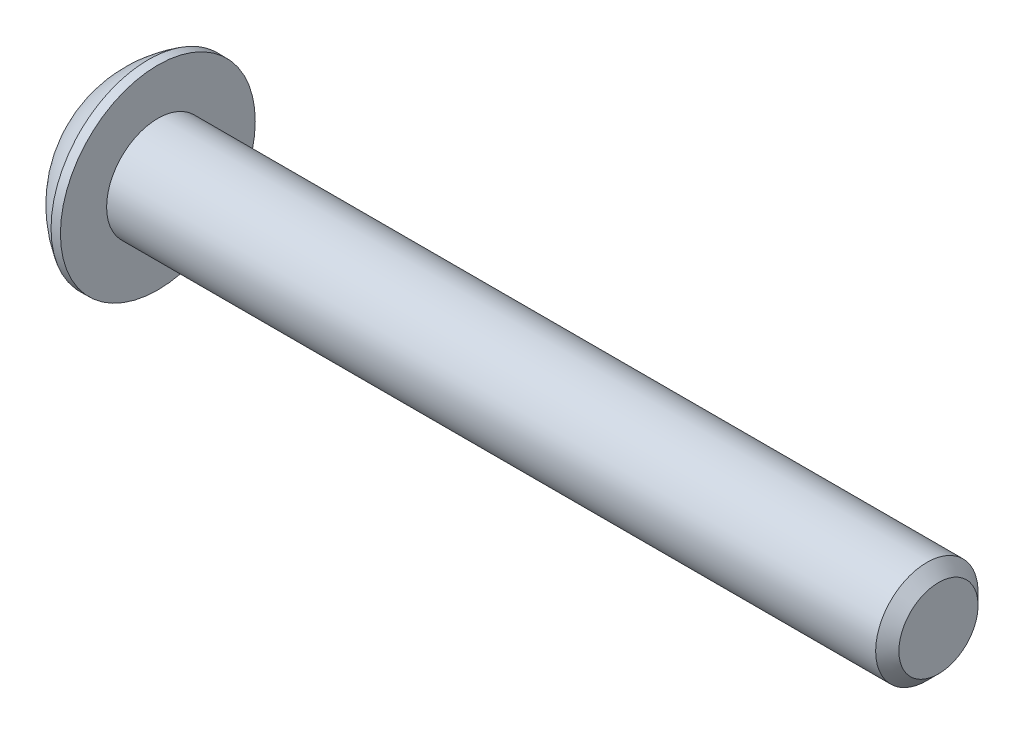
ISO-10303-21;
HEADER;
FILE_DESCRIPTION(('STEP AP214'),'2;1');
FILE_NAME('part.step','',(''),(''),'','','');
FILE_SCHEMA(('AUTOMOTIVE_DESIGN { 1 0 10303 214 1 1 1 1 }'));
ENDSEC;
DATA;
#1=APPLICATION_CONTEXT('core data for automotive mechanical design processes');
#2=APPLICATION_PROTOCOL_DEFINITION('international standard','automotive_design',2000,#1);
#3=PRODUCT_CONTEXT('',#1,'mechanical');
#4=PRODUCT('Part','Part','',(#3));
#5=PRODUCT_RELATED_PRODUCT_CATEGORY('part','',(#4));
#6=PRODUCT_DEFINITION_FORMATION('','',#4);
#7=PRODUCT_DEFINITION_CONTEXT('part definition',#1,'design');
#8=PRODUCT_DEFINITION('design','',#6,#7);
#9=PRODUCT_DEFINITION_SHAPE('','',#8);
#10=(LENGTH_UNIT() NAMED_UNIT(*) SI_UNIT(.MILLI.,.METRE.));
#11=(NAMED_UNIT(*) PLANE_ANGLE_UNIT() SI_UNIT($,.RADIAN.));
#12=(NAMED_UNIT(*) SI_UNIT($,.STERADIAN.) SOLID_ANGLE_UNIT());
#13=UNCERTAINTY_MEASURE_WITH_UNIT(LENGTH_MEASURE(1.E-05),#10,'distance_accuracy_value','');
#14=(GEOMETRIC_REPRESENTATION_CONTEXT(3) GLOBAL_UNCERTAINTY_ASSIGNED_CONTEXT((#13)) GLOBAL_UNIT_ASSIGNED_CONTEXT((#10,
#11,#12)) REPRESENTATION_CONTEXT('',''));
#15=CARTESIAN_POINT('',(0.,0.,0.));
#16=DIRECTION('',(0.,0.,1.));
#17=DIRECTION('',(1.,0.,0.));
#18=AXIS2_PLACEMENT_3D('',#15,#16,#17);
#19=CARTESIAN_POINT('',(1.32080000000034,0.,0.));
#20=DIRECTION('',(-1.,0.,0.));
#21=DIRECTION('',(0.,0.,1.));
#22=AXIS2_PLACEMENT_3D('',#19,#20,#21);
#23=CONICAL_SURFACE('',#22,1.1937999999998,1.04719755119608);
#24=CARTESIAN_POINT('',(2.01004075135902,0.,4.44089209850063E-13));
#25=VERTEX_POINT('',#24);
#26=VERTEX_LOOP('',#25);
#27=FACE_BOUND('',#26,.T.);
#28=CARTESIAN_POINT('',(1.32080000000009,0.,0.));
#29=DIRECTION('',(-1.,0.,0.));
#30=DIRECTION('',(0.,0.,1.));
#31=AXIS2_PLACEMENT_3D('',#28,#29,#30);
#32=CIRCLE('',#31,1.19380000000024);
#33=CARTESIAN_POINT('',(1.32080000000004,-1.03386112703797,0.596900000000061));
#34=VERTEX_POINT('',#33);
#35=CARTESIAN_POINT('',(1.32080000000004,0.,1.19380000000012));
#36=VERTEX_POINT('',#35);
#37=EDGE_CURVE('E19',#34,#36,#32,.T.);
#38=ORIENTED_EDGE('',*,*,#37,.T.);
#39=CARTESIAN_POINT('',(1.32080000000009,0.,0.));
#40=DIRECTION('',(-1.,0.,0.));
#41=DIRECTION('',(0.,0.,1.));
#42=AXIS2_PLACEMENT_3D('',#39,#40,#41);
#43=CIRCLE('',#42,1.19380000000024);
#44=CARTESIAN_POINT('',(1.32080000000004,1.03386112703797,0.59690000000006));
#45=VERTEX_POINT('',#44);
#46=EDGE_CURVE('E147',#36,#45,#43,.T.);
#47=ORIENTED_EDGE('',*,*,#46,.T.);
#48=CARTESIAN_POINT('',(1.32080000000009,0.,0.));
#49=DIRECTION('',(-1.,0.,0.));
#50=DIRECTION('',(0.,0.,1.));
#51=AXIS2_PLACEMENT_3D('',#48,#49,#50);
#52=CIRCLE('',#51,1.19380000000024);
#53=CARTESIAN_POINT('',(1.32080000000004,1.03386112703797,-0.59690000000006));
#54=VERTEX_POINT('',#53);
#55=EDGE_CURVE('E449',#45,#54,#52,.T.);
#56=ORIENTED_EDGE('',*,*,#55,.T.);
#57=CARTESIAN_POINT('',(1.32080000000009,0.,0.));
#58=DIRECTION('',(-1.,0.,0.));
#59=DIRECTION('',(0.,0.,1.));
#60=AXIS2_PLACEMENT_3D('',#57,#58,#59);
#61=CIRCLE('',#60,1.19380000000024);
#62=CARTESIAN_POINT('',(1.32080000000004,1.49457637585666E-12,-1.19380000000012));
#63=VERTEX_POINT('',#62);
#64=EDGE_CURVE('E450',#54,#63,#61,.T.);
#65=ORIENTED_EDGE('',*,*,#64,.T.);
#66=CARTESIAN_POINT('',(1.32080000000009,0.,0.));
#67=DIRECTION('',(-1.,0.,0.));
#68=DIRECTION('',(0.,0.,1.));
#69=AXIS2_PLACEMENT_3D('',#66,#67,#68);
#70=CIRCLE('',#69,1.19380000000024);
#71=CARTESIAN_POINT('',(1.32080000000004,-1.03386112703797,-0.596900000000061));
#72=VERTEX_POINT('',#71);
#73=EDGE_CURVE('E92',#63,#72,#70,.T.);
#74=ORIENTED_EDGE('',*,*,#73,.T.);
#75=CARTESIAN_POINT('',(1.32080000000009,0.,0.));
#76=DIRECTION('',(-1.,0.,0.));
#77=DIRECTION('',(0.,0.,1.));
#78=AXIS2_PLACEMENT_3D('',#75,#76,#77);
#79=CIRCLE('',#78,1.19380000000024);
#80=EDGE_CURVE('E88',#72,#34,#79,.T.);
#81=ORIENTED_EDGE('',*,*,#80,.T.);
#82=EDGE_LOOP('',(#38,#47,#56,#65,#74,#81));
#83=FACE_BOUND('',#82,.T.);
#84=ADVANCED_FACE('F16',(#27,#83),#23,.F.);
#85=CARTESIAN_POINT('',(1.3208,-2.06772225407573,-1.1938));
#86=DIRECTION('',(1.,0.,0.));
#87=DIRECTION('',(0.,0.,-1.));
#88=AXIS2_PLACEMENT_3D('',#85,#86,#87);
#89=PLANE('',#88);
#90=DIRECTION('',(0.,0.5,0.866025403784439));
#91=VECTOR('',#90,1.);
#92=CARTESIAN_POINT('',(1.3208,-1.37848150271715,0.));
#93=LINE('',#92,#91);
#94=CARTESIAN_POINT('',(1.3208,-0.689240751358575,1.1938));
#95=VERTEX_POINT('',#94);
#96=EDGE_CURVE('E100',#95,#34,#93,.F.);
#97=ORIENTED_EDGE('',*,*,#96,.F.);
#98=DIRECTION('',(0.,1.,0.));
#99=VECTOR('',#98,1.);
#100=CARTESIAN_POINT('',(1.3208,-0.689240751358575,1.1938));
#101=LINE('',#100,#99);
#102=EDGE_CURVE('E102',#36,#95,#101,.F.);
#103=ORIENTED_EDGE('',*,*,#102,.F.);
#104=ORIENTED_EDGE('',*,*,#37,.F.);
#105=EDGE_LOOP('',(#97,#103,#104));
#106=FACE_BOUND('',#105,.T.);
#107=ADVANCED_FACE('F98',(#106),#89,.F.);
#108=CARTESIAN_POINT('',(1.3208,-2.06772225407573,-1.1938));
#109=DIRECTION('',(1.,0.,0.));
#110=DIRECTION('',(0.,0.,-1.));
#111=AXIS2_PLACEMENT_3D('',#108,#109,#110);
#112=PLANE('',#111);
#113=DIRECTION('',(0.,-0.5,0.866025403784439));
#114=VECTOR('',#113,1.);
#115=CARTESIAN_POINT('',(1.3208,-0.689240751358575,-1.1938));
#116=LINE('',#115,#114);
#117=CARTESIAN_POINT('',(1.3208,-1.37848150271715,0.));
#118=VERTEX_POINT('',#117);
#119=EDGE_CURVE('E108',#118,#72,#116,.F.);
#120=ORIENTED_EDGE('',*,*,#119,.F.);
#121=DIRECTION('',(0.,0.5,0.866025403784439));
#122=VECTOR('',#121,1.);
#123=CARTESIAN_POINT('',(1.3208,-1.37848150271715,0.));
#124=LINE('',#123,#122);
#125=EDGE_CURVE('E105',#34,#118,#124,.F.);
#126=ORIENTED_EDGE('',*,*,#125,.F.);
#127=ORIENTED_EDGE('',*,*,#80,.F.);
#128=EDGE_LOOP('',(#120,#126,#127));
#129=FACE_BOUND('',#128,.T.);
#130=ADVANCED_FACE('F106',(#129),#112,.F.);
#131=CARTESIAN_POINT('',(1.3208,-2.06772225407573,-1.1938));
#132=DIRECTION('',(1.,0.,0.));
#133=DIRECTION('',(0.,0.,-1.));
#134=AXIS2_PLACEMENT_3D('',#131,#132,#133);
#135=PLANE('',#134);
#136=DIRECTION('',(0.,1.,0.));
#137=VECTOR('',#136,1.);
#138=CARTESIAN_POINT('',(1.3208,0.689240751358575,-1.1938));
#139=LINE('',#138,#137);
#140=CARTESIAN_POINT('',(1.3208,-0.689240751358575,-1.1938));
#141=VERTEX_POINT('',#140);
#142=EDGE_CURVE('E420',#141,#63,#139,.T.);
#143=ORIENTED_EDGE('',*,*,#142,.F.);
#144=DIRECTION('',(0.,-0.5,0.866025403784439));
#145=VECTOR('',#144,1.);
#146=CARTESIAN_POINT('',(1.3208,-0.689240751358575,-1.1938));
#147=LINE('',#146,#145);
#148=EDGE_CURVE('E432',#72,#141,#147,.F.);
#149=ORIENTED_EDGE('',*,*,#148,.F.);
#150=ORIENTED_EDGE('',*,*,#73,.F.);
#151=EDGE_LOOP('',(#143,#149,#150));
#152=FACE_BOUND('',#151,.T.);
#153=ADVANCED_FACE('F190',(#152),#135,.F.);
#154=CARTESIAN_POINT('',(1.3208,-2.06772225407573,-1.1938));
#155=DIRECTION('',(1.,0.,0.));
#156=DIRECTION('',(0.,0.,-1.));
#157=AXIS2_PLACEMENT_3D('',#154,#155,#156);
#158=PLANE('',#157);
#159=DIRECTION('',(0.,-0.499999999999999,-0.866025403784439));
#160=VECTOR('',#159,1.);
#161=CARTESIAN_POINT('',(1.3208,1.37848150271715,0.));
#162=LINE('',#161,#160);
#163=CARTESIAN_POINT('',(1.3208,0.689240751358575,-1.1938));
#164=VERTEX_POINT('',#163);
#165=EDGE_CURVE('E406',#164,#54,#162,.F.);
#166=ORIENTED_EDGE('',*,*,#165,.F.);
#167=DIRECTION('',(0.,1.,0.));
#168=VECTOR('',#167,1.);
#169=CARTESIAN_POINT('',(1.3208,0.689240751358575,-1.1938));
#170=LINE('',#169,#168);
#171=EDGE_CURVE('E417',#63,#164,#170,.T.);
#172=ORIENTED_EDGE('',*,*,#171,.F.);
#173=ORIENTED_EDGE('',*,*,#64,.F.);
#174=EDGE_LOOP('',(#166,#172,#173));
#175=FACE_BOUND('',#174,.T.);
#176=ADVANCED_FACE('F186',(#175),#158,.F.);
#177=CARTESIAN_POINT('',(1.3208,-2.06772225407573,-1.1938));
#178=DIRECTION('',(1.,0.,0.));
#179=DIRECTION('',(0.,0.,-1.));
#180=AXIS2_PLACEMENT_3D('',#177,#178,#179);
#181=PLANE('',#180);
#182=DIRECTION('',(0.,0.499999999999999,-0.866025403784439));
#183=VECTOR('',#182,1.);
#184=CARTESIAN_POINT('',(1.3208,0.689240751358575,1.1938));
#185=LINE('',#184,#183);
#186=CARTESIAN_POINT('',(1.3208,1.37848150271715,0.));
#187=VERTEX_POINT('',#186);
#188=EDGE_CURVE('E385',#187,#45,#185,.F.);
#189=ORIENTED_EDGE('',*,*,#188,.F.);
#190=DIRECTION('',(0.,-0.499999999999999,-0.866025403784439));
#191=VECTOR('',#190,1.);
#192=CARTESIAN_POINT('',(1.3208,1.37848150271715,0.));
#193=LINE('',#192,#191);
#194=EDGE_CURVE('E404',#54,#187,#193,.F.);
#195=ORIENTED_EDGE('',*,*,#194,.F.);
#196=ORIENTED_EDGE('',*,*,#55,.F.);
#197=EDGE_LOOP('',(#189,#195,#196));
#198=FACE_BOUND('',#197,.T.);
#199=ADVANCED_FACE('F182',(#198),#181,.F.);
#200=CARTESIAN_POINT('',(1.3208,-2.06772225407573,-1.1938));
#201=DIRECTION('',(1.,0.,0.));
#202=DIRECTION('',(0.,0.,-1.));
#203=AXIS2_PLACEMENT_3D('',#200,#201,#202);
#204=PLANE('',#203);
#205=DIRECTION('',(0.,1.,0.));
#206=VECTOR('',#205,1.);
#207=CARTESIAN_POINT('',(1.3208,-0.689240751358575,1.1938));
#208=LINE('',#207,#206);
#209=CARTESIAN_POINT('',(1.3208,0.689240751358575,1.1938));
#210=VERTEX_POINT('',#209);
#211=EDGE_CURVE('E117',#210,#36,#208,.F.);
#212=ORIENTED_EDGE('',*,*,#211,.F.);
#213=DIRECTION('',(0.,0.499999999999999,-0.866025403784439));
#214=VECTOR('',#213,1.);
#215=CARTESIAN_POINT('',(1.3208,0.689240751358575,1.1938));
#216=LINE('',#215,#214);
#217=EDGE_CURVE('E388',#45,#210,#216,.F.);
#218=ORIENTED_EDGE('',*,*,#217,.F.);
#219=ORIENTED_EDGE('',*,*,#46,.F.);
#220=EDGE_LOOP('',(#212,#218,#219));
#221=FACE_BOUND('',#220,.T.);
#222=ADVANCED_FACE('F178',(#221),#204,.F.);
#223=CARTESIAN_POINT('',(1.3208,-0.689240751358575,1.1938));
#224=DIRECTION('',(0.,0.,-1.));
#225=DIRECTION('',(0.,1.,0.));
#226=AXIS2_PLACEMENT_3D('',#223,#224,#225);
#227=PLANE('',#226);
#228=DIRECTION('',(0.,1.,0.));
#229=VECTOR('',#228,1.);
#230=CARTESIAN_POINT('',(0.,0.,1.1938));
#231=LINE('',#230,#229);
#232=CARTESIAN_POINT('',(0.,0.689240751358575,1.1938));
#233=VERTEX_POINT('',#232);
#234=CARTESIAN_POINT('',(0.,-0.689240751358575,1.1938));
#235=VERTEX_POINT('',#234);
#236=EDGE_CURVE('E382',#233,#235,#231,.F.);
#237=ORIENTED_EDGE('',*,*,#236,.F.);
#238=DIRECTION('',(1.,0.,0.));
#239=VECTOR('',#238,1.);
#240=CARTESIAN_POINT('',(1.3208,0.689240751358575,1.1938));
#241=LINE('',#240,#239);
#242=EDGE_CURVE('E394',#210,#233,#241,.F.);
#243=ORIENTED_EDGE('',*,*,#242,.F.);
#244=ORIENTED_EDGE('',*,*,#211,.T.);
#245=ORIENTED_EDGE('',*,*,#102,.T.);
#246=DIRECTION('',(1.,0.,0.));
#247=VECTOR('',#246,1.);
#248=CARTESIAN_POINT('',(1.3208,-0.689240751358575,1.1938));
#249=LINE('',#248,#247);
#250=EDGE_CURVE('E111',#235,#95,#249,.T.);
#251=ORIENTED_EDGE('',*,*,#250,.F.);
#252=EDGE_LOOP('',(#237,#243,#244,#245,#251));
#253=FACE_BOUND('',#252,.T.);
#254=ADVANCED_FACE('F175',(#253),#227,.T.);
#255=CARTESIAN_POINT('',(1.3208,-1.37848150271715,0.));
#256=DIRECTION('',(0.,0.866025403784439,-0.5));
#257=DIRECTION('',(0.,0.5,0.866025403784439));
#258=AXIS2_PLACEMENT_3D('',#255,#256,#257);
#259=PLANE('',#258);
#260=DIRECTION('',(0.,-0.5,-0.866025403784439));
#261=VECTOR('',#260,1.);
#262=CARTESIAN_POINT('',(0.,-0.689240751358575,1.1938));
#263=LINE('',#262,#261);
#264=CARTESIAN_POINT('',(0.,-1.37848150271715,0.));
#265=VERTEX_POINT('',#264);
#266=EDGE_CURVE('E379',#235,#265,#263,.T.);
#267=ORIENTED_EDGE('',*,*,#266,.F.);
#268=ORIENTED_EDGE('',*,*,#250,.T.);
#269=ORIENTED_EDGE('',*,*,#96,.T.);
#270=ORIENTED_EDGE('',*,*,#125,.T.);
#271=DIRECTION('',(1.,0.,0.));
#272=VECTOR('',#271,1.);
#273=CARTESIAN_POINT('',(1.3208,-1.37848150271715,0.));
#274=LINE('',#273,#272);
#275=EDGE_CURVE('E429',#265,#118,#274,.T.);
#276=ORIENTED_EDGE('',*,*,#275,.F.);
#277=EDGE_LOOP('',(#267,#268,#269,#270,#276));
#278=FACE_BOUND('',#277,.T.);
#279=ADVANCED_FACE('F115',(#278),#259,.T.);
#280=CARTESIAN_POINT('',(1.3208,-0.689240751358575,-1.1938));
#281=DIRECTION('',(0.,0.866025403784439,0.5));
#282=DIRECTION('',(0.,-0.5,0.866025403784439));
#283=AXIS2_PLACEMENT_3D('',#280,#281,#282);
#284=PLANE('',#283);
#285=DIRECTION('',(0.,0.5,-0.866025403784439));
#286=VECTOR('',#285,1.);
#287=CARTESIAN_POINT('',(0.,-1.37848150271715,0.));
#288=LINE('',#287,#286);
#289=CARTESIAN_POINT('',(0.,-0.689240751358575,-1.1938));
#290=VERTEX_POINT('',#289);
#291=EDGE_CURVE('E376',#265,#290,#288,.T.);
#292=ORIENTED_EDGE('',*,*,#291,.F.);
#293=ORIENTED_EDGE('',*,*,#275,.T.);
#294=ORIENTED_EDGE('',*,*,#119,.T.);
#295=ORIENTED_EDGE('',*,*,#148,.T.);
#296=DIRECTION('',(1.,0.,0.));
#297=VECTOR('',#296,1.);
#298=CARTESIAN_POINT('',(1.3208,-0.689240751358575,-1.1938));
#299=LINE('',#298,#297);
#300=EDGE_CURVE('E414',#290,#141,#299,.T.);
#301=ORIENTED_EDGE('',*,*,#300,.F.);
#302=EDGE_LOOP('',(#292,#293,#294,#295,#301));
#303=FACE_BOUND('',#302,.T.);
#304=ADVANCED_FACE('F168',(#303),#284,.T.);
#305=CARTESIAN_POINT('',(1.3208,0.689240751358575,-1.1938));
#306=DIRECTION('',(0.,0.,1.));
#307=DIRECTION('',(1.,0.,0.));
#308=AXIS2_PLACEMENT_3D('',#305,#306,#307);
#309=PLANE('',#308);
#310=DIRECTION('',(0.,1.,0.));
#311=VECTOR('',#310,1.);
#312=CARTESIAN_POINT('',(0.,0.,-1.1938));
#313=LINE('',#312,#311);
#314=CARTESIAN_POINT('',(0.,0.689240751358575,-1.1938));
#315=VERTEX_POINT('',#314);
#316=EDGE_CURVE('E373',#290,#315,#313,.T.);
#317=ORIENTED_EDGE('',*,*,#316,.F.);
#318=ORIENTED_EDGE('',*,*,#300,.T.);
#319=ORIENTED_EDGE('',*,*,#142,.T.);
#320=ORIENTED_EDGE('',*,*,#171,.T.);
#321=DIRECTION('',(1.,0.,0.));
#322=VECTOR('',#321,1.);
#323=CARTESIAN_POINT('',(1.3208,0.689240751358575,-1.1938));
#324=LINE('',#323,#322);
#325=EDGE_CURVE('E389',#315,#164,#324,.T.);
#326=ORIENTED_EDGE('',*,*,#325,.F.);
#327=EDGE_LOOP('',(#317,#318,#319,#320,#326));
#328=FACE_BOUND('',#327,.T.);
#329=ADVANCED_FACE('F165',(#328),#309,.T.);
#330=CARTESIAN_POINT('',(1.3208,1.37848150271715,0.));
#331=DIRECTION('',(0.,-0.866025403784439,0.499999999999999));
#332=DIRECTION('',(0.,-0.499999999999999,-0.866025403784439));
#333=AXIS2_PLACEMENT_3D('',#330,#331,#332);
#334=PLANE('',#333);
#335=DIRECTION('',(0.,0.499999999999999,0.866025403784439));
#336=VECTOR('',#335,1.);
#337=CARTESIAN_POINT('',(0.,0.689240751358575,-1.1938));
#338=LINE('',#337,#336);
#339=CARTESIAN_POINT('',(0.,1.37848150271715,0.));
#340=VERTEX_POINT('',#339);
#341=EDGE_CURVE('E370',#315,#340,#338,.T.);
#342=ORIENTED_EDGE('',*,*,#341,.F.);
#343=ORIENTED_EDGE('',*,*,#325,.T.);
#344=ORIENTED_EDGE('',*,*,#165,.T.);
#345=ORIENTED_EDGE('',*,*,#194,.T.);
#346=DIRECTION('',(1.,0.,0.));
#347=VECTOR('',#346,1.);
#348=CARTESIAN_POINT('',(1.3208,1.37848150271715,0.));
#349=LINE('',#348,#347);
#350=EDGE_CURVE('E34',#340,#187,#349,.T.);
#351=ORIENTED_EDGE('',*,*,#350,.F.);
#352=EDGE_LOOP('',(#342,#343,#344,#345,#351));
#353=FACE_BOUND('',#352,.T.);
#354=ADVANCED_FACE('F161',(#353),#334,.T.);
#355=CARTESIAN_POINT('',(1.3208,0.689240751358575,1.1938));
#356=DIRECTION('',(0.,-0.866025403784439,-0.499999999999999));
#357=DIRECTION('',(0.,0.499999999999999,-0.866025403784439));
#358=AXIS2_PLACEMENT_3D('',#355,#356,#357);
#359=PLANE('',#358);
#360=DIRECTION('',(0.,-0.499999999999999,0.866025403784439));
#361=VECTOR('',#360,1.);
#362=CARTESIAN_POINT('',(0.,1.37848150271715,0.));
#363=LINE('',#362,#361);
#364=EDGE_CURVE('E146',#340,#233,#363,.T.);
#365=ORIENTED_EDGE('',*,*,#364,.F.);
#366=ORIENTED_EDGE('',*,*,#350,.T.);
#367=ORIENTED_EDGE('',*,*,#188,.T.);
#368=ORIENTED_EDGE('',*,*,#217,.T.);
#369=ORIENTED_EDGE('',*,*,#242,.T.);
#370=EDGE_LOOP('',(#365,#366,#367,#368,#369));
#371=FACE_BOUND('',#370,.T.);
#372=ADVANCED_FACE('F157',(#371),#359,.T.);
#373=CARTESIAN_POINT('',(0.,0.,0.));
#374=DIRECTION('',(-1.,0.,0.));
#375=DIRECTION('',(0.,0.,1.));
#376=AXIS2_PLACEMENT_3D('',#373,#374,#375);
#377=PLANE('',#376);
#378=ORIENTED_EDGE('',*,*,#341,.T.);
#379=ORIENTED_EDGE('',*,*,#364,.T.);
#380=ORIENTED_EDGE('',*,*,#236,.T.);
#381=ORIENTED_EDGE('',*,*,#266,.T.);
#382=ORIENTED_EDGE('',*,*,#291,.T.);
#383=ORIENTED_EDGE('',*,*,#316,.T.);
#384=EDGE_LOOP('',(#378,#379,#380,#381,#382,#383));
#385=FACE_BOUND('',#384,.T.);
#386=CARTESIAN_POINT('',(0.,1.9812,0.));
#387=CARTESIAN_POINT('',(0.,1.9811996664299,0.0556258831179427));
#388=CARTESIAN_POINT('',(0.,1.97885520380442,0.111261989398606));
#389=CARTESIAN_POINT('',(0.,1.96949260169541,0.222149719830457));
#390=CARTESIAN_POINT('',(0.,1.96247308239605,0.277401225602895));
#391=CARTESIAN_POINT('',(0.,1.94379192841038,0.387209508139748));
#392=CARTESIAN_POINT('',(-1.85684713606366E-13,1.93212292489526,0.441765039546365));
#393=CARTESIAN_POINT('',(1.86703426467969E-13,1.90422331175315,0.549729449347493));
#394=CARTESIAN_POINT('',(6.95912300261454E-13,1.88798900035338,0.60313735920887));
#395=CARTESIAN_POINT('',(1.15748432216766E-12,1.83266214476501,0.760839131321829));
#396=CARTESIAN_POINT('',(0.,1.78690023648845,0.862876433575429));
#397=CARTESIAN_POINT('',(0.,1.67887358150667,1.05780719540872));
#398=CARTESIAN_POINT('',(9.54133844997183E-13,1.6166082074585,1.15070030720801));
#399=CARTESIAN_POINT('',(5.94835315740768E-13,1.51224157140982,1.28116890915698));
#400=CARTESIAN_POINT('',(1.63152335675163E-13,1.4755970394354,1.32320451127027));
#401=CARTESIAN_POINT('',(-1.62128088646011E-13,1.39893832619713,1.40400288695709));
#402=CARTESIAN_POINT('',(0.,1.35892742784699,1.44276877695455));
#403=CARTESIAN_POINT('',(1.13752532132066E-13,1.23416504602197,1.55382272417904));
#404=CARTESIAN_POINT('',(0.,1.14466125559859,1.62089527952111));
#405=CARTESIAN_POINT('',(0.,0.95571214417816,1.73902218081179));
#406=CARTESIAN_POINT('',(0.,0.856267198233559,1.79007713076007));
#407=CARTESIAN_POINT('',(0.,0.650206345910839,1.87477637530954));
#408=CARTESIAN_POINT('',(0.,0.543590516134851,1.90842085586267));
#409=CARTESIAN_POINT('',(0.,0.326226155292014,1.95733039300656));
#410=CARTESIAN_POINT('',(0.,0.215477602157926,1.97259535144288));
#411=CARTESIAN_POINT('',(0.,-0.00701040587545038,1.98431697865418));
#412=CARTESIAN_POINT('',(0.,-0.118749860774738,1.98077364742917));
#413=CARTESIAN_POINT('',(0.,-0.340050178355489,1.95497485623825));
#414=CARTESIAN_POINT('',(0.,-0.449611052668259,1.93271949620218));
#415=CARTESIAN_POINT('',(0.,-0.663431110729178,1.87014138774524));
#416=CARTESIAN_POINT('',(0.,-0.767690237838526,1.82981844635272));
#417=CARTESIAN_POINT('',(0.,-0.968005760719351,1.73219968377097));
#418=CARTESIAN_POINT('',(0.,-1.0640618469811,1.6749032225164));
#419=CARTESIAN_POINT('',(0.,-1.19980276751284,1.57757371205873));
#420=CARTESIAN_POINT('',(0.,-1.24366557129214,1.54322665019466));
#421=CARTESIAN_POINT('',(0.,-1.32838995706696,1.47093063174264));
#422=CARTESIAN_POINT('',(0.,-1.36924860178707,1.4329782310244));
#423=CARTESIAN_POINT('',(0.,-1.48674671849224,1.31419842051173));
#424=CARTESIAN_POINT('',(0.,-1.55842832343237,1.22836221289311));
#425=CARTESIAN_POINT('',(0.,-1.6863396856475,1.04586168272493));
#426=CARTESIAN_POINT('',(0.,-1.74257003024881,0.949197771949777));
#427=CARTESIAN_POINT('',(0.,-1.81416142504011,0.798182600298686));
#428=CARTESIAN_POINT('',(0.,-1.83591780585876,0.746776203847792));
#429=CARTESIAN_POINT('',(0.,-1.87500754181093,0.642341081688636));
#430=CARTESIAN_POINT('',(0.,-1.89234447645405,0.589313708122847));
#431=CARTESIAN_POINT('',(0.,-1.92246053433555,0.482076273028395));
#432=CARTESIAN_POINT('',(0.,-1.93524685475119,0.427868224257511));
#433=CARTESIAN_POINT('',(0.,-1.95620937250495,0.318578151844612));
#434=CARTESIAN_POINT('',(0.,-1.96438692958148,0.263496390912872));
#435=CARTESIAN_POINT('',(0.,-1.97388528284654,0.173607715038558));
#436=CARTESIAN_POINT('',(0.,-1.97662743364427,0.138944718024998));
#437=CARTESIAN_POINT('',(0.,-1.98028489645284,0.0695224782567004));
#438=CARTESIAN_POINT('',(0.,-1.98120020846368,0.0347632355019632));
#439=CARTESIAN_POINT('',(0.,-1.98119966642991,-0.0556258831179439));
#440=CARTESIAN_POINT('',(0.,-1.97885520380443,-0.111261989398607));
#441=CARTESIAN_POINT('',(0.,-1.96949260169542,-0.222149719830459));
#442=CARTESIAN_POINT('',(0.,-1.96247308239606,-0.277401225602897));
#443=CARTESIAN_POINT('',(0.,-1.9437919284104,-0.387209508139749));
#444=CARTESIAN_POINT('',(-1.85663518818529E-13,-1.93212292489527,-0.441765039546366));
#445=CARTESIAN_POINT('',(1.8668221444457E-13,-1.90422331175316,-0.549729449347494));
#446=CARTESIAN_POINT('',(6.95851299742614E-13,-1.88798900035339,-0.603137359208871));
#447=CARTESIAN_POINT('',(1.15760603242308E-12,-1.83266214476502,-0.76083913132183));
#448=CARTESIAN_POINT('',(0.,-1.78690023648846,-0.86287643357543));
#449=CARTESIAN_POINT('',(0.,-1.67887358150668,-1.05780719540872));
#450=CARTESIAN_POINT('',(9.51676789209375E-13,-1.61660820745851,-1.15070030720801));
#451=CARTESIAN_POINT('',(5.93462231683297E-13,-1.51224157140983,-1.28116890915698));
#452=CARTESIAN_POINT('',(1.62776229463016E-13,-1.47559703943541,-1.32320451127027));
#453=CARTESIAN_POINT('',(-1.61752345056899E-13,-1.39893832619714,-1.40400288695709));
#454=CARTESIAN_POINT('',(0.,-1.35892742784699,-1.44276877695455));
#455=CARTESIAN_POINT('',(1.13488992312735E-13,-1.23416504602198,-1.55382272417904));
#456=CARTESIAN_POINT('',(0.,-1.1446612555986,-1.62089527952111));
#457=CARTESIAN_POINT('',(0.,-0.955712144178172,-1.7390221808118));
#458=CARTESIAN_POINT('',(0.,-0.856267198233569,-1.79007713076007));
#459=CARTESIAN_POINT('',(0.,-0.650206345910848,-1.87477637530954));
#460=CARTESIAN_POINT('',(0.,-0.54359051613486,-1.90842085586267));
#461=CARTESIAN_POINT('',(0.,-0.326226155292023,-1.95733039300656));
#462=CARTESIAN_POINT('',(0.,-0.215477602157935,-1.97259535144288));
#463=CARTESIAN_POINT('',(0.,0.00701040587544162,-1.98431697865418));
#464=CARTESIAN_POINT('',(0.,0.118749860774729,-1.98077364742916));
#465=CARTESIAN_POINT('',(0.,0.340050178355481,-1.95497485623824));
#466=CARTESIAN_POINT('',(0.,0.449611052668251,-1.93271949620218));
#467=CARTESIAN_POINT('',(0.,0.663431110729171,-1.87014138774524));
#468=CARTESIAN_POINT('',(0.,0.767690237838518,-1.82981844635273));
#469=CARTESIAN_POINT('',(0.,0.968005760719342,-1.73219968377097));
#470=CARTESIAN_POINT('',(0.,1.06406184698109,-1.6749032225164));
#471=CARTESIAN_POINT('',(0.,1.19980276751283,-1.57757371205873));
#472=CARTESIAN_POINT('',(0.,1.24366557129213,-1.54322665019466));
#473=CARTESIAN_POINT('',(0.,1.32838995706696,-1.47093063174264));
#474=CARTESIAN_POINT('',(0.,1.36924860178706,-1.4329782310244));
#475=CARTESIAN_POINT('',(0.,1.48674671849222,-1.31419842051173));
#476=CARTESIAN_POINT('',(0.,1.55842832343237,-1.22836221289311));
#477=CARTESIAN_POINT('',(0.,1.6863396856475,-1.04586168272493));
#478=CARTESIAN_POINT('',(0.,1.74257003024879,-0.949197771949774));
#479=CARTESIAN_POINT('',(0.,1.8141614250401,-0.798182600298684));
#480=CARTESIAN_POINT('',(0.,1.83591780585875,-0.746776203847791));
#481=CARTESIAN_POINT('',(0.,1.87500754181092,-0.642341081688635));
#482=CARTESIAN_POINT('',(0.,1.89234447645404,-0.589313708122846));
#483=CARTESIAN_POINT('',(0.,1.92246053433554,-0.482076273028394));
#484=CARTESIAN_POINT('',(0.,1.93524685475117,-0.42786822425751));
#485=CARTESIAN_POINT('',(0.,1.95620937250493,-0.318578151844611));
#486=CARTESIAN_POINT('',(0.,1.96438692958147,-0.263496390912871));
#487=CARTESIAN_POINT('',(0.,1.97388528284653,-0.173607715038558));
#488=CARTESIAN_POINT('',(0.,1.97662743364426,-0.138944718024998));
#489=CARTESIAN_POINT('',(0.,1.98028489645283,-0.0695224782567008));
#490=CARTESIAN_POINT('',(0.,1.98120020846367,-0.0347632355019639));
#491=CARTESIAN_POINT('',(0.,1.9812,0.));
#492=B_SPLINE_CURVE_WITH_KNOTS('',3,(#386,#387,#388,#389,#390,#391,#392,#393,#394,#395,#396,
#397,#398,#399,#400,#401,#402,#403,#404,#405,#406,#407,#408,#409,#410,#411,#412,#413,#414,#415,
#416,#417,#418,#419,#420,#421,#422,#423,#424,#425,#426,#427,#428,#429,#430,#431,#432,#433,#434,
#435,#436,#437,#438,#439,#440,#441,#442,#443,#444,#445,#446,#447,#448,#449,#450,#451,#452,#453,
#454,#455,#456,#457,#458,#459,#460,#461,#462,#463,#464,#465,#466,#467,#468,#469,#470,#471,#472,
#473,#474,#475,#476,#477,#478,#479,#480,#481,#482,#483,#484,#485,#486,#487,#488,#489,#490,#491),
.UNSPECIFIED.,.T.,.F.,(4,2,2,2,2,2,2,2,2,2,2,2,2,2,2,2,2,2,2,2,2,2,2,2,2,2,2,2,2,2,2,2,2,2,2,2,
2,2,2,2,2,2,2,2,2,2,2,2,2,2,2,2,4),(0.,0.166845646007828,0.333740557374255,0.500901034367693,
0.668197445942387,1.00199278686282,1.33580081809885,1.50292354032982,1.6698851310853,
2.00370118900129,2.33750465770544,2.67130456115909,3.00510624723801,3.33890793331696,
3.67270783677065,4.00651130547476,4.34032736339027,4.50728895414555,4.67441167637632,
5.0082197076126,5.34201504853333,5.50931146010828,5.67647193710192,5.84336684846845,
6.01021249447641,6.11448220058335,6.2187519066903,6.38559755269813,6.55249246406455,
6.71965294105799,6.88694935263269,7.22074469355312,7.55455272478916,7.72167544702012,
7.8886370377756,8.22245309569159,8.55625656439574,8.89005646784939,9.22385815392831,
9.55765984000726,9.89145974346095,10.2252632121651,10.5590792700806,10.7260408608358,
10.8931635830666,11.2269716143029,11.5607669552236,11.7280633667986,11.8952238437922,
12.0621187551587,12.2289644011667,12.3332341072736,12.4375038133806),.UNSPECIFIED.);
#493=CARTESIAN_POINT('',(0.,1.9812,0.));
#494=VERTEX_POINT('',#493);
#495=EDGE_CURVE('E139',#494,#494,#492,.T.);
#496=ORIENTED_EDGE('',*,*,#495,.F.);
#497=EDGE_LOOP('',(#496));
#498=FACE_BOUND('',#497,.T.);
#499=ADVANCED_FACE('F153',(#385,#498),#377,.T.);
#500=CARTESIAN_POINT('',(4.13385000000001,0.,0.));
#501=DIRECTION('',(0.,1.,0.));
#502=DIRECTION('',(1.,0.,0.));
#503=AXIS2_PLACEMENT_3D('',#500,#501,#502);
#504=SPHERICAL_SURFACE('',#503,4.5840887057844);
#505=CARTESIAN_POINT('',(1.8288,0.,0.));
#506=DIRECTION('',(-1.,0.,0.));
#507=DIRECTION('',(0.,0.,1.));
#508=AXIS2_PLACEMENT_3D('',#505,#506,#507);
#509=CIRCLE('',#508,3.9624);
#510=CARTESIAN_POINT('',(1.8288,0.,3.9624));
#511=VERTEX_POINT('',#510);
#512=EDGE_CURVE('E136',#511,#511,#509,.F.);
#513=ORIENTED_EDGE('',*,*,#512,.F.);
#514=EDGE_LOOP('',(#513));
#515=FACE_BOUND('',#514,.T.);
#516=ORIENTED_EDGE('',*,*,#495,.T.);
#517=EDGE_LOOP('',(#516));
#518=FACE_BOUND('',#517,.T.);
#519=ADVANCED_FACE('F149',(#515,#518),#504,.T.);
#520=CARTESIAN_POINT('',(33.9598,0.,0.));
#521=DIRECTION('',(-1.,0.,0.));
#522=DIRECTION('',(0.,0.,1.));
#523=AXIS2_PLACEMENT_3D('',#520,#521,#522);
#524=PLANE('',#523);
#525=CARTESIAN_POINT('',(33.9598000000478,0.,0.));
#526=DIRECTION('',(-1.,0.,0.));
#527=DIRECTION('',(0.,0.,1.));
#528=AXIS2_PLACEMENT_3D('',#525,#526,#527);
#529=CIRCLE('',#528,1.61035999997239);
#530=CARTESIAN_POINT('',(33.9598000000478,0.,1.61035999997239));
#531=VERTEX_POINT('',#530);
#532=EDGE_CURVE('E133',#531,#531,#529,.T.);
#533=ORIENTED_EDGE('',*,*,#532,.F.);
#534=EDGE_LOOP('',(#533));
#535=FACE_BOUND('',#534,.T.);
#536=ADVANCED_FACE('F221',(#535),#524,.F.);
#537=CARTESIAN_POINT('',(0.,0.,0.));
#538=DIRECTION('',(-1.,0.,0.));
#539=DIRECTION('',(0.,0.,1.));
#540=AXIS2_PLACEMENT_3D('',#537,#538,#539);
#541=CYLINDRICAL_SURFACE('',#540,3.9624);
#542=ORIENTED_EDGE('',*,*,#512,.T.);
#543=EDGE_LOOP('',(#542));
#544=FACE_BOUND('',#543,.T.);
#545=CARTESIAN_POINT('',(2.2098,0.,0.));
#546=DIRECTION('',(-1.,0.,0.));
#547=DIRECTION('',(0.,0.,1.));
#548=AXIS2_PLACEMENT_3D('',#545,#546,#547);
#549=CIRCLE('',#548,3.9624);
#550=CARTESIAN_POINT('',(2.2098,0.,3.9624));
#551=VERTEX_POINT('',#550);
#552=EDGE_CURVE('E130',#551,#551,#549,.T.);
#553=ORIENTED_EDGE('',*,*,#552,.T.);
#554=EDGE_LOOP('',(#553));
#555=FACE_BOUND('',#554,.T.);
#556=ADVANCED_FACE('F218',(#544,#555),#541,.T.);
#557=CARTESIAN_POINT('',(33.4873600000378,0.,0.));
#558=DIRECTION('',(-1.,0.,0.));
#559=DIRECTION('',(0.,0.,1.));
#560=AXIS2_PLACEMENT_3D('',#557,#558,#559);
#561=CONICAL_SURFACE('',#560,2.08279999992556,0.785398163337289);
#562=CARTESIAN_POINT('',(33.48736,0.,0.));
#563=DIRECTION('',(-1.,0.,0.));
#564=DIRECTION('',(0.,0.,1.));
#565=AXIS2_PLACEMENT_3D('',#562,#563,#564);
#566=CIRCLE('',#565,2.08279999999999);
#567=CARTESIAN_POINT('',(33.48736,0.,2.08279999999999));
#568=VERTEX_POINT('',#567);
#569=EDGE_CURVE('E25',#568,#568,#566,.T.);
#570=ORIENTED_EDGE('',*,*,#569,.F.);
#571=EDGE_LOOP('',(#570));
#572=FACE_BOUND('',#571,.T.);
#573=ORIENTED_EDGE('',*,*,#532,.T.);
#574=EDGE_LOOP('',(#573));
#575=FACE_BOUND('',#574,.T.);
#576=ADVANCED_FACE('F211',(#572,#575),#561,.T.);
#577=CARTESIAN_POINT('',(2.2098,2.08279999999999,0.));
#578=DIRECTION('',(-1.,0.,0.));
#579=DIRECTION('',(0.,0.,1.));
#580=AXIS2_PLACEMENT_3D('',#577,#578,#579);
#581=PLANE('',#580);
#582=CARTESIAN_POINT('',(2.2098,0.,0.));
#583=DIRECTION('',(-1.,0.,0.));
#584=DIRECTION('',(0.,0.,1.));
#585=AXIS2_PLACEMENT_3D('',#582,#583,#584);
#586=CIRCLE('',#585,2.08279999999999);
#587=CARTESIAN_POINT('',(2.2098,0.,2.08279999999999));
#588=VERTEX_POINT('',#587);
#589=EDGE_CURVE('E11',#588,#588,#586,.F.);
#590=ORIENTED_EDGE('',*,*,#589,.F.);
#591=EDGE_LOOP('',(#590));
#592=FACE_BOUND('',#591,.T.);
#593=ORIENTED_EDGE('',*,*,#552,.F.);
#594=EDGE_LOOP('',(#593));
#595=FACE_BOUND('',#594,.T.);
#596=ADVANCED_FACE('F205',(#592,#595),#581,.F.);
#597=CARTESIAN_POINT('',(0.,0.,0.));
#598=DIRECTION('',(-1.,0.,0.));
#599=DIRECTION('',(0.,0.,1.));
#600=AXIS2_PLACEMENT_3D('',#597,#598,#599);
#601=CYLINDRICAL_SURFACE('',#600,2.08279999999999);
#602=ORIENTED_EDGE('',*,*,#589,.T.);
#603=EDGE_LOOP('',(#602));
#604=FACE_BOUND('',#603,.T.);
#605=ORIENTED_EDGE('',*,*,#569,.T.);
#606=EDGE_LOOP('',(#605));
#607=FACE_BOUND('',#606,.T.);
#608=ADVANCED_FACE('F203',(#604,#607),#601,.T.);
#609=CLOSED_SHELL('',(#84,#107,#130,#153,#176,#199,#222,#254,#279,#304,#329,#354,#372,#499,#519,
#536,#556,#576,#596,#608));
#610=MANIFOLD_SOLID_BREP('B1',#609);
#611=ADVANCED_BREP_SHAPE_REPRESENTATION('',(#18,#610),#14);
#612=SHAPE_DEFINITION_REPRESENTATION(#9,#611);
ENDSEC;
END-ISO-10303-21;
